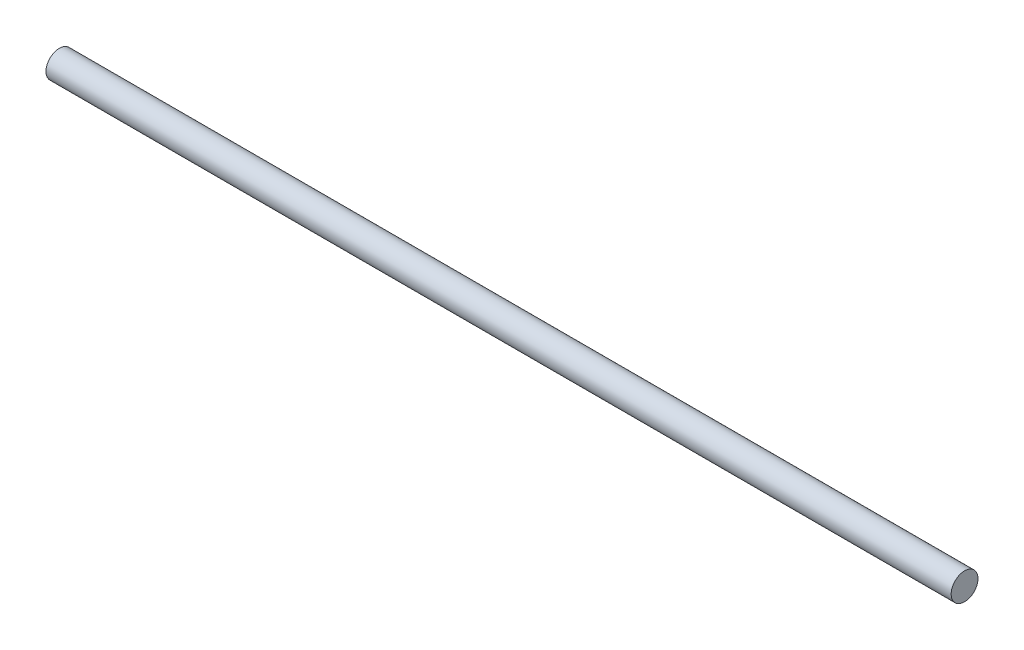
ISO-10303-21;
HEADER;
FILE_DESCRIPTION(('STEP AP214'),'2;1');
FILE_NAME('part.step','',(''),(''),'','','');
FILE_SCHEMA(('AUTOMOTIVE_DESIGN { 1 0 10303 214 1 1 1 1 }'));
ENDSEC;
DATA;
#1=APPLICATION_CONTEXT('core data for automotive mechanical design processes');
#2=APPLICATION_PROTOCOL_DEFINITION('international standard','automotive_design',2000,#1);
#3=PRODUCT_CONTEXT('',#1,'mechanical');
#4=PRODUCT('Part','Part','',(#3));
#5=PRODUCT_RELATED_PRODUCT_CATEGORY('part','',(#4));
#6=PRODUCT_DEFINITION_FORMATION('','',#4);
#7=PRODUCT_DEFINITION_CONTEXT('part definition',#1,'design');
#8=PRODUCT_DEFINITION('design','',#6,#7);
#9=PRODUCT_DEFINITION_SHAPE('','',#8);
#10=(LENGTH_UNIT() NAMED_UNIT(*) SI_UNIT(.MILLI.,.METRE.));
#11=(NAMED_UNIT(*) PLANE_ANGLE_UNIT() SI_UNIT($,.RADIAN.));
#12=(NAMED_UNIT(*) SI_UNIT($,.STERADIAN.) SOLID_ANGLE_UNIT());
#13=UNCERTAINTY_MEASURE_WITH_UNIT(LENGTH_MEASURE(1.E-05),#10,'distance_accuracy_value','');
#14=(GEOMETRIC_REPRESENTATION_CONTEXT(3) GLOBAL_UNCERTAINTY_ASSIGNED_CONTEXT((#13)) GLOBAL_UNIT_ASSIGNED_CONTEXT((#10,
#11,#12)) REPRESENTATION_CONTEXT('',''));
#15=CARTESIAN_POINT('',(0.,0.,0.));
#16=DIRECTION('',(0.,0.,1.));
#17=DIRECTION('',(1.,0.,0.));
#18=AXIS2_PLACEMENT_3D('',#15,#16,#17);
#19=CARTESIAN_POINT('',(118.,0.,0.));
#20=DIRECTION('',(-1.,0.,0.));
#21=DIRECTION('',(0.,0.,1.));
#22=AXIS2_PLACEMENT_3D('',#19,#20,#21);
#23=CYLINDRICAL_SURFACE('',#22,1.75);
#24=CARTESIAN_POINT('',(118.,0.,0.));
#25=DIRECTION('',(1.,0.,0.));
#26=DIRECTION('',(0.,0.,-1.));
#27=AXIS2_PLACEMENT_3D('',#24,#25,#26);
#28=CIRCLE('',#27,1.75);
#29=CARTESIAN_POINT('',(118.,0.,-1.75));
#30=VERTEX_POINT('',#29);
#31=EDGE_CURVE('E10',#30,#30,#28,.T.);
#32=ORIENTED_EDGE('',*,*,#31,.F.);
#33=EDGE_LOOP('',(#32));
#34=FACE_BOUND('',#33,.T.);
#35=CARTESIAN_POINT('',(0.,0.,0.));
#36=DIRECTION('',(1.,0.,0.));
#37=DIRECTION('',(0.,0.,-1.));
#38=AXIS2_PLACEMENT_3D('',#35,#36,#37);
#39=CIRCLE('',#38,1.75);
#40=CARTESIAN_POINT('',(0.,0.,-1.75));
#41=VERTEX_POINT('',#40);
#42=EDGE_CURVE('E35',#41,#41,#39,.T.);
#43=ORIENTED_EDGE('',*,*,#42,.T.);
#44=EDGE_LOOP('',(#43));
#45=FACE_BOUND('',#44,.T.);
#46=ADVANCED_FACE('F32',(#34,#45),#23,.T.);
#47=CARTESIAN_POINT('',(118.,0.,0.));
#48=DIRECTION('',(1.,0.,0.));
#49=DIRECTION('',(0.,0.,-1.));
#50=AXIS2_PLACEMENT_3D('',#47,#48,#49);
#51=PLANE('',#50);
#52=ORIENTED_EDGE('',*,*,#31,.T.);
#53=EDGE_LOOP('',(#52));
#54=FACE_BOUND('',#53,.T.);
#55=ADVANCED_FACE('F47',(#54),#51,.T.);
#56=CARTESIAN_POINT('',(0.,0.,0.));
#57=DIRECTION('',(1.,0.,0.));
#58=DIRECTION('',(0.,0.,-1.));
#59=AXIS2_PLACEMENT_3D('',#56,#57,#58);
#60=PLANE('',#59);
#61=ORIENTED_EDGE('',*,*,#42,.F.);
#62=EDGE_LOOP('',(#61));
#63=FACE_BOUND('',#62,.T.);
#64=ADVANCED_FACE('F45',(#63),#60,.F.);
#65=CLOSED_SHELL('',(#46,#55,#64));
#66=MANIFOLD_SOLID_BREP('B2',#65);
#67=ADVANCED_BREP_SHAPE_REPRESENTATION('',(#18,#66),#14);
#68=SHAPE_DEFINITION_REPRESENTATION(#9,#67);
ENDSEC;
END-ISO-10303-21;
